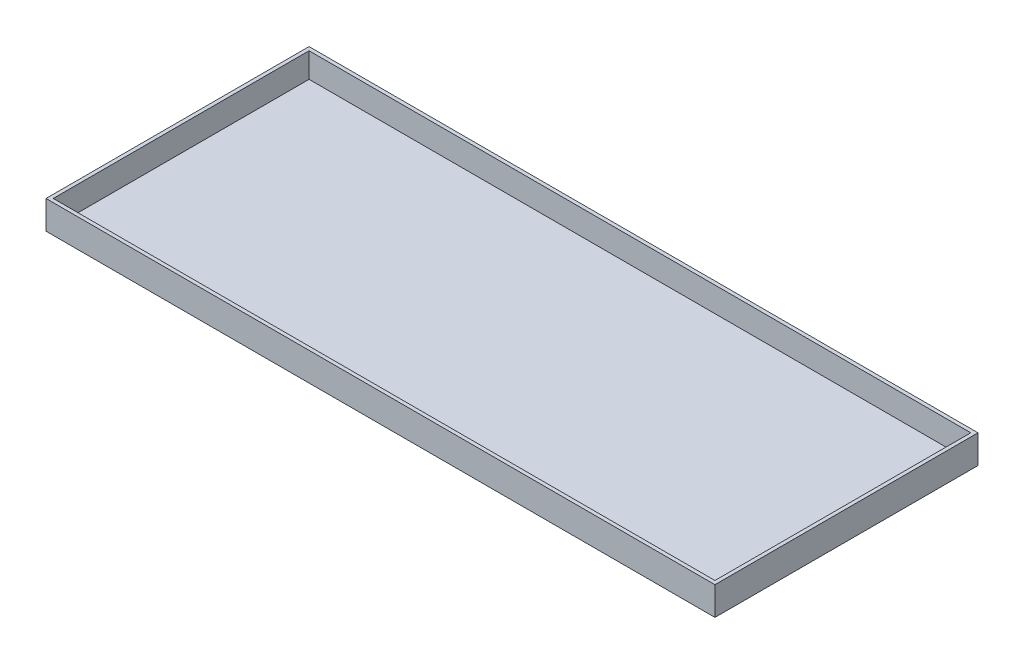
ISO-10303-21;
HEADER;
FILE_DESCRIPTION(('STEP AP214'),'2;1');
FILE_NAME('part.step','',(''),(''),'','','');
FILE_SCHEMA(('AUTOMOTIVE_DESIGN { 1 0 10303 214 1 1 1 1 }'));
ENDSEC;
DATA;
#1=APPLICATION_CONTEXT('core data for automotive mechanical design processes');
#2=APPLICATION_PROTOCOL_DEFINITION('international standard','automotive_design',2000,#1);
#3=PRODUCT_CONTEXT('',#1,'mechanical');
#4=PRODUCT('Part','Part','',(#3));
#5=PRODUCT_RELATED_PRODUCT_CATEGORY('part','',(#4));
#6=PRODUCT_DEFINITION_FORMATION('','',#4);
#7=PRODUCT_DEFINITION_CONTEXT('part definition',#1,'design');
#8=PRODUCT_DEFINITION('design','',#6,#7);
#9=PRODUCT_DEFINITION_SHAPE('','',#8);
#10=(LENGTH_UNIT() NAMED_UNIT(*) SI_UNIT(.MILLI.,.METRE.));
#11=(NAMED_UNIT(*) PLANE_ANGLE_UNIT() SI_UNIT($,.RADIAN.));
#12=(NAMED_UNIT(*) SI_UNIT($,.STERADIAN.) SOLID_ANGLE_UNIT());
#13=UNCERTAINTY_MEASURE_WITH_UNIT(LENGTH_MEASURE(1.E-05),#10,'distance_accuracy_value','');
#14=(GEOMETRIC_REPRESENTATION_CONTEXT(3) GLOBAL_UNCERTAINTY_ASSIGNED_CONTEXT((#13)) GLOBAL_UNIT_ASSIGNED_CONTEXT((#10,
#11,#12)) REPRESENTATION_CONTEXT('',''));
#15=CARTESIAN_POINT('',(0.,0.,0.));
#16=DIRECTION('',(0.,0.,1.));
#17=DIRECTION('',(1.,0.,0.));
#18=AXIS2_PLACEMENT_3D('',#15,#16,#17);
#19=CARTESIAN_POINT('',(35.3314,2.9972,-13.8938));
#20=DIRECTION('',(-1.,0.,0.));
#21=DIRECTION('',(0.,0.,1.));
#22=AXIS2_PLACEMENT_3D('',#19,#20,#21);
#23=PLANE('',#22);
#24=DIRECTION('',(0.,0.,-1.));
#25=VECTOR('',#24,1.);
#26=CARTESIAN_POINT('',(35.3314,0.,-13.8938));
#27=LINE('',#26,#25);
#28=CARTESIAN_POINT('',(35.3314,0.,13.8938));
#29=VERTEX_POINT('',#28);
#30=CARTESIAN_POINT('',(35.3314,0.,-13.8938));
#31=VERTEX_POINT('',#30);
#32=EDGE_CURVE('E147',#29,#31,#27,.T.);
#33=ORIENTED_EDGE('',*,*,#32,.T.);
#34=DIRECTION('',(0.,-1.,0.));
#35=VECTOR('',#34,1.);
#36=CARTESIAN_POINT('',(35.3314,2.9972,-13.8938));
#37=LINE('',#36,#35);
#38=CARTESIAN_POINT('',(35.3314,2.9972,-13.8938));
#39=VERTEX_POINT('',#38);
#40=EDGE_CURVE('E11',#39,#31,#37,.T.);
#41=ORIENTED_EDGE('',*,*,#40,.F.);
#42=DIRECTION('',(0.,0.,-1.));
#43=VECTOR('',#42,1.);
#44=CARTESIAN_POINT('',(35.3314,2.9972,-13.8938));
#45=LINE('',#44,#43);
#46=CARTESIAN_POINT('',(35.3314,2.9972,13.8938));
#47=VERTEX_POINT('',#46);
#48=EDGE_CURVE('E140',#47,#39,#45,.T.);
#49=ORIENTED_EDGE('',*,*,#48,.F.);
#50=DIRECTION('',(0.,-1.,0.));
#51=VECTOR('',#50,1.);
#52=CARTESIAN_POINT('',(35.3314,2.9972,13.8938));
#53=LINE('',#52,#51);
#54=EDGE_CURVE('E146',#47,#29,#53,.T.);
#55=ORIENTED_EDGE('',*,*,#54,.T.);
#56=EDGE_LOOP('',(#33,#41,#49,#55));
#57=FACE_BOUND('',#56,.T.);
#58=ADVANCED_FACE('F33',(#57),#23,.F.);
#59=CARTESIAN_POINT('',(-35.3314,2.9972,-13.8938));
#60=DIRECTION('',(0.,0.,1.));
#61=DIRECTION('',(1.,0.,0.));
#62=AXIS2_PLACEMENT_3D('',#59,#60,#61);
#63=PLANE('',#62);
#64=DIRECTION('',(-1.,0.,0.));
#65=VECTOR('',#64,1.);
#66=CARTESIAN_POINT('',(-35.3314,0.,-13.8938));
#67=LINE('',#66,#65);
#68=CARTESIAN_POINT('',(-35.3314,0.,-13.8938));
#69=VERTEX_POINT('',#68);
#70=EDGE_CURVE('E150',#31,#69,#67,.T.);
#71=ORIENTED_EDGE('',*,*,#70,.T.);
#72=DIRECTION('',(0.,-1.,0.));
#73=VECTOR('',#72,1.);
#74=CARTESIAN_POINT('',(-35.3314,2.9972,-13.8938));
#75=LINE('',#74,#73);
#76=CARTESIAN_POINT('',(-35.3314,2.9972,-13.8938));
#77=VERTEX_POINT('',#76);
#78=EDGE_CURVE('E40',#77,#69,#75,.T.);
#79=ORIENTED_EDGE('',*,*,#78,.F.);
#80=DIRECTION('',(-1.,0.,0.));
#81=VECTOR('',#80,1.);
#82=CARTESIAN_POINT('',(-35.3314,2.9972,-13.8938));
#83=LINE('',#82,#81);
#84=EDGE_CURVE('E84',#39,#77,#83,.T.);
#85=ORIENTED_EDGE('',*,*,#84,.F.);
#86=ORIENTED_EDGE('',*,*,#40,.T.);
#87=EDGE_LOOP('',(#71,#79,#85,#86));
#88=FACE_BOUND('',#87,.T.);
#89=ADVANCED_FACE('F179',(#88),#63,.F.);
#90=CARTESIAN_POINT('',(-35.3314,2.9972,-13.8938));
#91=DIRECTION('',(1.,0.,0.));
#92=DIRECTION('',(0.,0.,-1.));
#93=AXIS2_PLACEMENT_3D('',#90,#91,#92);
#94=PLANE('',#93);
#95=DIRECTION('',(0.,0.,1.));
#96=VECTOR('',#95,1.);
#97=CARTESIAN_POINT('',(-35.3314,0.,-13.8938));
#98=LINE('',#97,#96);
#99=CARTESIAN_POINT('',(-35.3314,0.,13.8938));
#100=VERTEX_POINT('',#99);
#101=EDGE_CURVE('E152',#69,#100,#98,.T.);
#102=ORIENTED_EDGE('',*,*,#101,.T.);
#103=DIRECTION('',(0.,-1.,0.));
#104=VECTOR('',#103,1.);
#105=CARTESIAN_POINT('',(-35.3314,2.9972,13.8938));
#106=LINE('',#105,#104);
#107=CARTESIAN_POINT('',(-35.3314,2.9972,13.8938));
#108=VERTEX_POINT('',#107);
#109=EDGE_CURVE('E156',#108,#100,#106,.T.);
#110=ORIENTED_EDGE('',*,*,#109,.F.);
#111=DIRECTION('',(0.,0.,1.));
#112=VECTOR('',#111,1.);
#113=CARTESIAN_POINT('',(-35.3314,2.9972,-13.8938));
#114=LINE('',#113,#112);
#115=EDGE_CURVE('E143',#77,#108,#114,.T.);
#116=ORIENTED_EDGE('',*,*,#115,.F.);
#117=ORIENTED_EDGE('',*,*,#78,.T.);
#118=EDGE_LOOP('',(#102,#110,#116,#117));
#119=FACE_BOUND('',#118,.T.);
#120=ADVANCED_FACE('F161',(#119),#94,.F.);
#121=CARTESIAN_POINT('',(-35.3314,2.9972,13.8938));
#122=DIRECTION('',(0.,0.,-1.));
#123=DIRECTION('',(-1.,0.,0.));
#124=AXIS2_PLACEMENT_3D('',#121,#122,#123);
#125=PLANE('',#124);
#126=DIRECTION('',(1.,0.,0.));
#127=VECTOR('',#126,1.);
#128=CARTESIAN_POINT('',(-35.3314,0.,13.8938));
#129=LINE('',#128,#127);
#130=EDGE_CURVE('E77',#100,#29,#129,.T.);
#131=ORIENTED_EDGE('',*,*,#130,.T.);
#132=ORIENTED_EDGE('',*,*,#54,.F.);
#133=DIRECTION('',(1.,0.,0.));
#134=VECTOR('',#133,1.);
#135=CARTESIAN_POINT('',(-35.3314,2.9972,13.8938));
#136=LINE('',#135,#134);
#137=EDGE_CURVE('E56',#108,#47,#136,.T.);
#138=ORIENTED_EDGE('',*,*,#137,.F.);
#139=ORIENTED_EDGE('',*,*,#109,.T.);
#140=EDGE_LOOP('',(#131,#132,#138,#139));
#141=FACE_BOUND('',#140,.T.);
#142=ADVANCED_FACE('F169',(#141),#125,.F.);
#143=CARTESIAN_POINT('',(0.,2.9972,0.));
#144=DIRECTION('',(0.,1.,0.));
#145=DIRECTION('',(0.,0.,1.));
#146=AXIS2_PLACEMENT_3D('',#143,#144,#145);
#147=PLANE('',#146);
#148=DIRECTION('',(0.,0.,-1.));
#149=VECTOR('',#148,1.);
#150=CARTESIAN_POINT('',(34.9504,2.9972,-13.8938));
#151=LINE('',#150,#149);
#152=CARTESIAN_POINT('',(34.9504,2.9972,13.5128));
#153=VERTEX_POINT('',#152);
#154=CARTESIAN_POINT('',(34.9504,2.9972,-13.5128));
#155=VERTEX_POINT('',#154);
#156=EDGE_CURVE('E129',#153,#155,#151,.T.);
#157=ORIENTED_EDGE('',*,*,#156,.F.);
#158=DIRECTION('',(1.,0.,0.));
#159=VECTOR('',#158,1.);
#160=CARTESIAN_POINT('',(-35.3314,2.9972,13.5128));
#161=LINE('',#160,#159);
#162=CARTESIAN_POINT('',(-34.9504,2.9972,13.5128));
#163=VERTEX_POINT('',#162);
#164=EDGE_CURVE('E138',#163,#153,#161,.T.);
#165=ORIENTED_EDGE('',*,*,#164,.F.);
#166=DIRECTION('',(0.,0.,1.));
#167=VECTOR('',#166,1.);
#168=CARTESIAN_POINT('',(-34.9504,2.9972,-13.8938));
#169=LINE('',#168,#167);
#170=CARTESIAN_POINT('',(-34.9504,2.9972,-13.5128));
#171=VERTEX_POINT('',#170);
#172=EDGE_CURVE('E136',#171,#163,#169,.T.);
#173=ORIENTED_EDGE('',*,*,#172,.F.);
#174=DIRECTION('',(-1.,0.,0.));
#175=VECTOR('',#174,1.);
#176=CARTESIAN_POINT('',(-35.3314,2.9972,-13.5128));
#177=LINE('',#176,#175);
#178=EDGE_CURVE('E121',#155,#171,#177,.T.);
#179=ORIENTED_EDGE('',*,*,#178,.F.);
#180=EDGE_LOOP('',(#157,#165,#173,#179));
#181=FACE_BOUND('',#180,.T.);
#182=ORIENTED_EDGE('',*,*,#48,.T.);
#183=ORIENTED_EDGE('',*,*,#84,.T.);
#184=ORIENTED_EDGE('',*,*,#115,.T.);
#185=ORIENTED_EDGE('',*,*,#137,.T.);
#186=EDGE_LOOP('',(#182,#183,#184,#185));
#187=FACE_BOUND('',#186,.T.);
#188=ADVANCED_FACE('F171',(#181,#187),#147,.T.);
#189=CARTESIAN_POINT('',(0.,0.,0.));
#190=DIRECTION('',(0.,1.,0.));
#191=DIRECTION('',(0.,0.,1.));
#192=AXIS2_PLACEMENT_3D('',#189,#190,#191);
#193=PLANE('',#192);
#194=ORIENTED_EDGE('',*,*,#32,.F.);
#195=ORIENTED_EDGE('',*,*,#130,.F.);
#196=ORIENTED_EDGE('',*,*,#101,.F.);
#197=ORIENTED_EDGE('',*,*,#70,.F.);
#198=EDGE_LOOP('',(#194,#195,#196,#197));
#199=FACE_BOUND('',#198,.T.);
#200=ADVANCED_FACE('F165',(#199),#193,.F.);
#201=CARTESIAN_POINT('',(34.9504,2.9972,-13.8938));
#202=DIRECTION('',(-1.,0.,0.));
#203=DIRECTION('',(0.,0.,1.));
#204=AXIS2_PLACEMENT_3D('',#201,#202,#203);
#205=PLANE('',#204);
#206=DIRECTION('',(0.,0.,-1.));
#207=VECTOR('',#206,1.);
#208=CARTESIAN_POINT('',(34.9504,0.381,-13.8938));
#209=LINE('',#208,#207);
#210=CARTESIAN_POINT('',(34.9504,0.381,13.5128));
#211=VERTEX_POINT('',#210);
#212=CARTESIAN_POINT('',(34.9504,0.381,-13.5128));
#213=VERTEX_POINT('',#212);
#214=EDGE_CURVE('E112',#211,#213,#209,.T.);
#215=ORIENTED_EDGE('',*,*,#214,.F.);
#216=DIRECTION('',(0.,-1.,0.));
#217=VECTOR('',#216,1.);
#218=CARTESIAN_POINT('',(34.9504,2.9972,13.5128));
#219=LINE('',#218,#217);
#220=EDGE_CURVE('E132',#153,#211,#219,.T.);
#221=ORIENTED_EDGE('',*,*,#220,.F.);
#222=ORIENTED_EDGE('',*,*,#156,.T.);
#223=DIRECTION('',(0.,-1.,0.));
#224=VECTOR('',#223,1.);
#225=CARTESIAN_POINT('',(34.9504,2.9972,-13.5128));
#226=LINE('',#225,#224);
#227=EDGE_CURVE('E124',#155,#213,#226,.T.);
#228=ORIENTED_EDGE('',*,*,#227,.T.);
#229=EDGE_LOOP('',(#215,#221,#222,#228));
#230=FACE_BOUND('',#229,.T.);
#231=ADVANCED_FACE('F206',(#230),#205,.T.);
#232=CARTESIAN_POINT('',(-35.3314,2.9972,-13.5128));
#233=DIRECTION('',(0.,0.,1.));
#234=DIRECTION('',(1.,0.,0.));
#235=AXIS2_PLACEMENT_3D('',#232,#233,#234);
#236=PLANE('',#235);
#237=DIRECTION('',(-1.,0.,0.));
#238=VECTOR('',#237,1.);
#239=CARTESIAN_POINT('',(-35.3314,0.381,-13.5128));
#240=LINE('',#239,#238);
#241=CARTESIAN_POINT('',(-34.9504,0.381,-13.5128));
#242=VERTEX_POINT('',#241);
#243=EDGE_CURVE('E106',#213,#242,#240,.T.);
#244=ORIENTED_EDGE('',*,*,#243,.F.);
#245=ORIENTED_EDGE('',*,*,#227,.F.);
#246=ORIENTED_EDGE('',*,*,#178,.T.);
#247=DIRECTION('',(0.,-1.,0.));
#248=VECTOR('',#247,1.);
#249=CARTESIAN_POINT('',(-34.9504,2.9972,-13.5128));
#250=LINE('',#249,#248);
#251=EDGE_CURVE('E118',#171,#242,#250,.T.);
#252=ORIENTED_EDGE('',*,*,#251,.T.);
#253=EDGE_LOOP('',(#244,#245,#246,#252));
#254=FACE_BOUND('',#253,.T.);
#255=ADVANCED_FACE('F119',(#254),#236,.T.);
#256=CARTESIAN_POINT('',(-34.9504,2.9972,-13.8938));
#257=DIRECTION('',(1.,0.,0.));
#258=DIRECTION('',(0.,0.,-1.));
#259=AXIS2_PLACEMENT_3D('',#256,#257,#258);
#260=PLANE('',#259);
#261=DIRECTION('',(0.,0.,1.));
#262=VECTOR('',#261,1.);
#263=CARTESIAN_POINT('',(-34.9504,0.381,-13.8938));
#264=LINE('',#263,#262);
#265=CARTESIAN_POINT('',(-34.9504,0.381,13.5128));
#266=VERTEX_POINT('',#265);
#267=EDGE_CURVE('E110',#242,#266,#264,.T.);
#268=ORIENTED_EDGE('',*,*,#267,.F.);
#269=ORIENTED_EDGE('',*,*,#251,.F.);
#270=ORIENTED_EDGE('',*,*,#172,.T.);
#271=DIRECTION('',(0.,-1.,0.));
#272=VECTOR('',#271,1.);
#273=CARTESIAN_POINT('',(-34.9504,2.9972,13.5128));
#274=LINE('',#273,#272);
#275=EDGE_CURVE('E47',#163,#266,#274,.T.);
#276=ORIENTED_EDGE('',*,*,#275,.T.);
#277=EDGE_LOOP('',(#268,#269,#270,#276));
#278=FACE_BOUND('',#277,.T.);
#279=ADVANCED_FACE('F126',(#278),#260,.T.);
#280=CARTESIAN_POINT('',(-35.3314,2.9972,13.5128));
#281=DIRECTION('',(0.,0.,-1.));
#282=DIRECTION('',(-1.,0.,0.));
#283=AXIS2_PLACEMENT_3D('',#280,#281,#282);
#284=PLANE('',#283);
#285=DIRECTION('',(1.,0.,0.));
#286=VECTOR('',#285,1.);
#287=CARTESIAN_POINT('',(-35.3314,0.381,13.5128));
#288=LINE('',#287,#286);
#289=EDGE_CURVE('E127',#266,#211,#288,.T.);
#290=ORIENTED_EDGE('',*,*,#289,.F.);
#291=ORIENTED_EDGE('',*,*,#275,.F.);
#292=ORIENTED_EDGE('',*,*,#164,.T.);
#293=ORIENTED_EDGE('',*,*,#220,.T.);
#294=EDGE_LOOP('',(#290,#291,#292,#293));
#295=FACE_BOUND('',#294,.T.);
#296=ADVANCED_FACE('F236',(#295),#284,.T.);
#297=CARTESIAN_POINT('',(0.,0.381,0.));
#298=DIRECTION('',(0.,1.,0.));
#299=DIRECTION('',(0.,0.,1.));
#300=AXIS2_PLACEMENT_3D('',#297,#298,#299);
#301=PLANE('',#300);
#302=ORIENTED_EDGE('',*,*,#214,.T.);
#303=ORIENTED_EDGE('',*,*,#243,.T.);
#304=ORIENTED_EDGE('',*,*,#267,.T.);
#305=ORIENTED_EDGE('',*,*,#289,.T.);
#306=EDGE_LOOP('',(#302,#303,#304,#305));
#307=FACE_BOUND('',#306,.T.);
#308=ADVANCED_FACE('F108',(#307),#301,.T.);
#309=CLOSED_SHELL('',(#58,#89,#120,#142,#188,#200,#231,#255,#279,#296,#308));
#310=MANIFOLD_SOLID_BREP('B2',#309);
#311=ADVANCED_BREP_SHAPE_REPRESENTATION('',(#18,#310),#14);
#312=SHAPE_DEFINITION_REPRESENTATION(#9,#311);
ENDSEC;
END-ISO-10303-21;
